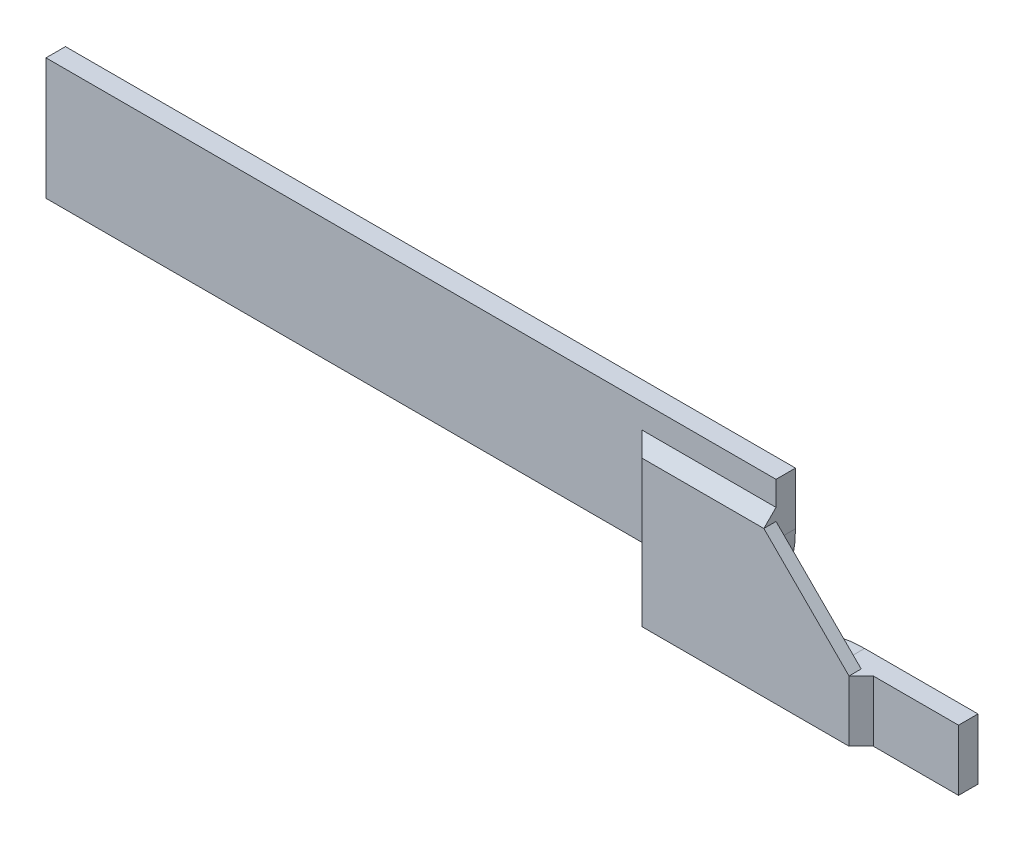
ISO-10303-21;
HEADER;
FILE_DESCRIPTION(('STEP AP214'),'2;1');
FILE_NAME('part.step','',(''),(''),'','','');
FILE_SCHEMA(('AUTOMOTIVE_DESIGN { 1 0 10303 214 1 1 1 1 }'));
ENDSEC;
DATA;
#1=APPLICATION_CONTEXT('core data for automotive mechanical design processes');
#2=APPLICATION_PROTOCOL_DEFINITION('international standard','automotive_design',2000,#1);
#3=PRODUCT_CONTEXT('',#1,'mechanical');
#4=PRODUCT('Part','Part','',(#3));
#5=PRODUCT_RELATED_PRODUCT_CATEGORY('part','',(#4));
#6=PRODUCT_DEFINITION_FORMATION('','',#4);
#7=PRODUCT_DEFINITION_CONTEXT('part definition',#1,'design');
#8=PRODUCT_DEFINITION('design','',#6,#7);
#9=PRODUCT_DEFINITION_SHAPE('','',#8);
#10=(LENGTH_UNIT() NAMED_UNIT(*) SI_UNIT(.MILLI.,.METRE.));
#11=(NAMED_UNIT(*) PLANE_ANGLE_UNIT() SI_UNIT($,.RADIAN.));
#12=(NAMED_UNIT(*) SI_UNIT($,.STERADIAN.) SOLID_ANGLE_UNIT());
#13=UNCERTAINTY_MEASURE_WITH_UNIT(LENGTH_MEASURE(1.E-05),#10,'distance_accuracy_value','');
#14=(GEOMETRIC_REPRESENTATION_CONTEXT(3) GLOBAL_UNCERTAINTY_ASSIGNED_CONTEXT((#13)) GLOBAL_UNIT_ASSIGNED_CONTEXT((#10,
#11,#12)) REPRESENTATION_CONTEXT('',''));
#15=CARTESIAN_POINT('',(0.,0.,0.));
#16=DIRECTION('',(0.,0.,1.));
#17=DIRECTION('',(1.,0.,0.));
#18=AXIS2_PLACEMENT_3D('',#15,#16,#17);
#19=CARTESIAN_POINT('',(60.,0.,1.6));
#20=DIRECTION('',(0.,0.,1.));
#21=DIRECTION('',(1.,0.,0.));
#22=AXIS2_PLACEMENT_3D('',#19,#20,#21);
#23=PLANE('',#22);
#24=DIRECTION('',(-1.,0.,0.));
#25=VECTOR('',#24,1.);
#26=CARTESIAN_POINT('',(75.,0.,1.6));
#27=LINE('',#26,#25);
#28=CARTESIAN_POINT('',(75.,0.,1.6));
#29=VERTEX_POINT('',#28);
#30=CARTESIAN_POINT('',(68.,0.,1.6));
#31=VERTEX_POINT('',#30);
#32=EDGE_CURVE('E198',#29,#31,#27,.T.);
#33=ORIENTED_EDGE('',*,*,#32,.T.);
#34=DIRECTION('',(0.,-1.,0.));
#35=VECTOR('',#34,1.);
#36=CARTESIAN_POINT('',(68.,0.,1.6));
#37=LINE('',#36,#35);
#38=CARTESIAN_POINT('',(68.,-5.,1.6));
#39=VERTEX_POINT('',#38);
#40=EDGE_CURVE('E250',#31,#39,#37,.T.);
#41=ORIENTED_EDGE('',*,*,#40,.T.);
#42=DIRECTION('',(1.,0.,0.));
#43=VECTOR('',#42,1.);
#44=CARTESIAN_POINT('',(50.,-5.,1.6));
#45=LINE('',#44,#43);
#46=CARTESIAN_POINT('',(75.,-5.,1.6));
#47=VERTEX_POINT('',#46);
#48=EDGE_CURVE('E193',#39,#47,#45,.T.);
#49=ORIENTED_EDGE('',*,*,#48,.T.);
#50=DIRECTION('',(0.,1.,0.));
#51=VECTOR('',#50,1.);
#52=CARTESIAN_POINT('',(75.,-5.,1.6));
#53=LINE('',#52,#51);
#54=EDGE_CURVE('E195',#47,#29,#53,.T.);
#55=ORIENTED_EDGE('',*,*,#54,.T.);
#56=EDGE_LOOP('',(#33,#41,#49,#55));
#57=FACE_BOUND('',#56,.T.);
#58=ADVANCED_FACE('F33',(#57),#23,.T.);
#59=CARTESIAN_POINT('',(0.,10.,1.6));
#60=DIRECTION('',(1.,0.,0.));
#61=DIRECTION('',(0.,1.,0.));
#62=AXIS2_PLACEMENT_3D('',#59,#60,#61);
#63=PLANE('',#62);
#64=DIRECTION('',(0.,-1.,0.));
#65=VECTOR('',#64,1.);
#66=CARTESIAN_POINT('',(0.,10.,0.));
#67=LINE('',#66,#65);
#68=CARTESIAN_POINT('',(0.,10.,0.));
#69=VERTEX_POINT('',#68);
#70=CARTESIAN_POINT('',(0.,0.,0.));
#71=VERTEX_POINT('',#70);
#72=EDGE_CURVE('E184',#69,#71,#67,.T.);
#73=ORIENTED_EDGE('',*,*,#72,.T.);
#74=DIRECTION('',(0.,0.,-1.));
#75=VECTOR('',#74,1.);
#76=CARTESIAN_POINT('',(0.,0.,1.6));
#77=LINE('',#76,#75);
#78=CARTESIAN_POINT('',(0.,0.,1.6));
#79=VERTEX_POINT('',#78);
#80=EDGE_CURVE('E244',#79,#71,#77,.T.);
#81=ORIENTED_EDGE('',*,*,#80,.F.);
#82=DIRECTION('',(0.,-1.,0.));
#83=VECTOR('',#82,1.);
#84=CARTESIAN_POINT('',(0.,10.,1.6));
#85=LINE('',#84,#83);
#86=CARTESIAN_POINT('',(0.,10.,1.6));
#87=VERTEX_POINT('',#86);
#88=EDGE_CURVE('E186',#87,#79,#85,.T.);
#89=ORIENTED_EDGE('',*,*,#88,.F.);
#90=DIRECTION('',(0.,0.,-1.));
#91=VECTOR('',#90,1.);
#92=CARTESIAN_POINT('',(0.,10.,1.6));
#93=LINE('',#92,#91);
#94=EDGE_CURVE('E208',#87,#69,#93,.T.);
#95=ORIENTED_EDGE('',*,*,#94,.T.);
#96=EDGE_LOOP('',(#73,#81,#89,#95));
#97=FACE_BOUND('',#96,.T.);
#98=ADVANCED_FACE('F316',(#97),#63,.F.);
#99=CARTESIAN_POINT('',(0.,0.,1.6));
#100=DIRECTION('',(0.,1.,0.));
#101=DIRECTION('',(-1.,0.,0.));
#102=AXIS2_PLACEMENT_3D('',#99,#100,#101);
#103=PLANE('',#102);
#104=DIRECTION('',(1.,0.,0.));
#105=VECTOR('',#104,1.);
#106=CARTESIAN_POINT('',(0.,0.,0.));
#107=LINE('',#106,#105);
#108=CARTESIAN_POINT('',(50.,0.,0.));
#109=VERTEX_POINT('',#108);
#110=EDGE_CURVE('E211',#71,#109,#107,.T.);
#111=ORIENTED_EDGE('',*,*,#110,.T.);
#112=DIRECTION('',(0.,0.,-1.));
#113=VECTOR('',#112,1.);
#114=CARTESIAN_POINT('',(50.,0.,1.6));
#115=LINE('',#114,#113);
#116=CARTESIAN_POINT('',(50.,0.,2.6));
#117=VERTEX_POINT('',#116);
#118=EDGE_CURVE('E241',#117,#109,#115,.T.);
#119=ORIENTED_EDGE('',*,*,#118,.F.);
#120=DIRECTION('',(-0.707106781186545,0.,-0.70710678118655));
#121=VECTOR('',#120,1.);
#122=CARTESIAN_POINT('',(24.5000000000002,0.,-22.9));
#123=LINE('',#122,#121);
#124=CARTESIAN_POINT('',(49.,0.,1.6));
#125=VERTEX_POINT('',#124);
#126=EDGE_CURVE('E166',#117,#125,#123,.T.);
#127=ORIENTED_EDGE('',*,*,#126,.T.);
#128=DIRECTION('',(1.,0.,0.));
#129=VECTOR('',#128,1.);
#130=CARTESIAN_POINT('',(0.,0.,1.6));
#131=LINE('',#130,#129);
#132=EDGE_CURVE('E189',#79,#125,#131,.T.);
#133=ORIENTED_EDGE('',*,*,#132,.F.);
#134=ORIENTED_EDGE('',*,*,#80,.T.);
#135=EDGE_LOOP('',(#111,#119,#127,#133,#134));
#136=FACE_BOUND('',#135,.T.);
#137=ADVANCED_FACE('F310',(#136),#103,.F.);
#138=CARTESIAN_POINT('',(50.,0.,1.6));
#139=DIRECTION('',(1.,0.,0.));
#140=DIRECTION('',(0.,0.,-1.));
#141=AXIS2_PLACEMENT_3D('',#138,#139,#140);
#142=PLANE('',#141);
#143=DIRECTION('',(0.,-1.,0.));
#144=VECTOR('',#143,1.);
#145=CARTESIAN_POINT('',(50.,-5.,2.6));
#146=LINE('',#145,#144);
#147=CARTESIAN_POINT('',(50.,-5.,2.6));
#148=VERTEX_POINT('',#147);
#149=EDGE_CURVE('E169',#117,#148,#146,.T.);
#150=ORIENTED_EDGE('',*,*,#149,.F.);
#151=ORIENTED_EDGE('',*,*,#118,.T.);
#152=DIRECTION('',(0.,-1.,0.));
#153=VECTOR('',#152,1.);
#154=CARTESIAN_POINT('',(50.,0.,0.));
#155=LINE('',#154,#153);
#156=CARTESIAN_POINT('',(50.,-5.,0.));
#157=VERTEX_POINT('',#156);
#158=EDGE_CURVE('E213',#109,#157,#155,.T.);
#159=ORIENTED_EDGE('',*,*,#158,.T.);
#160=DIRECTION('',(0.,0.,-1.));
#161=VECTOR('',#160,1.);
#162=CARTESIAN_POINT('',(50.,-5.,1.6));
#163=LINE('',#162,#161);
#164=EDGE_CURVE('E238',#148,#157,#163,.T.);
#165=ORIENTED_EDGE('',*,*,#164,.F.);
#166=EDGE_LOOP('',(#150,#151,#159,#165));
#167=FACE_BOUND('',#166,.T.);
#168=ADVANCED_FACE('F308',(#167),#142,.F.);
#169=CARTESIAN_POINT('',(50.,-5.,1.6));
#170=DIRECTION('',(0.,1.,0.));
#171=DIRECTION('',(0.,0.,1.));
#172=AXIS2_PLACEMENT_3D('',#169,#170,#171);
#173=PLANE('',#172);
#174=DIRECTION('',(1.,0.,0.));
#175=VECTOR('',#174,1.);
#176=CARTESIAN_POINT('',(50.,-5.,0.));
#177=LINE('',#176,#175);
#178=CARTESIAN_POINT('',(75.,-5.,0.));
#179=VERTEX_POINT('',#178);
#180=EDGE_CURVE('E215',#157,#179,#177,.T.);
#181=ORIENTED_EDGE('',*,*,#180,.T.);
#182=DIRECTION('',(0.,0.,-1.));
#183=VECTOR('',#182,1.);
#184=CARTESIAN_POINT('',(75.,-5.,1.6));
#185=LINE('',#184,#183);
#186=EDGE_CURVE('E235',#47,#179,#185,.T.);
#187=ORIENTED_EDGE('',*,*,#186,.F.);
#188=ORIENTED_EDGE('',*,*,#48,.F.);
#189=DIRECTION('',(-0.707106781186545,0.,0.70710678118655));
#190=VECTOR('',#189,1.);
#191=CARTESIAN_POINT('',(59.0000000000001,-5.,10.6));
#192=LINE('',#191,#190);
#193=CARTESIAN_POINT('',(67.,-5.,2.6));
#194=VERTEX_POINT('',#193);
#195=EDGE_CURVE('E257',#39,#194,#192,.T.);
#196=ORIENTED_EDGE('',*,*,#195,.T.);
#197=DIRECTION('',(1.,0.,0.));
#198=VECTOR('',#197,1.);
#199=CARTESIAN_POINT('',(67.,-5.,2.6));
#200=LINE('',#199,#198);
#201=EDGE_CURVE('E168',#148,#194,#200,.T.);
#202=ORIENTED_EDGE('',*,*,#201,.F.);
#203=ORIENTED_EDGE('',*,*,#164,.T.);
#204=EDGE_LOOP('',(#181,#187,#188,#196,#202,#203));
#205=FACE_BOUND('',#204,.T.);
#206=ADVANCED_FACE('F302',(#205),#173,.F.);
#207=CARTESIAN_POINT('',(75.,-5.,1.6));
#208=DIRECTION('',(-1.,0.,0.));
#209=DIRECTION('',(0.,0.,1.));
#210=AXIS2_PLACEMENT_3D('',#207,#208,#209);
#211=PLANE('',#210);
#212=DIRECTION('',(0.,1.,0.));
#213=VECTOR('',#212,1.);
#214=CARTESIAN_POINT('',(75.,-5.,0.));
#215=LINE('',#214,#213);
#216=CARTESIAN_POINT('',(75.,0.,0.));
#217=VERTEX_POINT('',#216);
#218=EDGE_CURVE('E217',#179,#217,#215,.T.);
#219=ORIENTED_EDGE('',*,*,#218,.T.);
#220=DIRECTION('',(0.,0.,-1.));
#221=VECTOR('',#220,1.);
#222=CARTESIAN_POINT('',(75.,0.,1.6));
#223=LINE('',#222,#221);
#224=EDGE_CURVE('E232',#29,#217,#223,.T.);
#225=ORIENTED_EDGE('',*,*,#224,.F.);
#226=ORIENTED_EDGE('',*,*,#54,.F.);
#227=ORIENTED_EDGE('',*,*,#186,.T.);
#228=EDGE_LOOP('',(#219,#225,#226,#227));
#229=FACE_BOUND('',#228,.T.);
#230=ADVANCED_FACE('F297',(#229),#211,.F.);
#231=CARTESIAN_POINT('',(75.,0.,1.6));
#232=DIRECTION('',(0.,-1.,0.));
#233=DIRECTION('',(1.,0.,0.));
#234=AXIS2_PLACEMENT_3D('',#231,#232,#233);
#235=PLANE('',#234);
#236=DIRECTION('',(-1.,0.,0.));
#237=VECTOR('',#236,1.);
#238=CARTESIAN_POINT('',(75.,0.,0.));
#239=LINE('',#238,#237);
#240=CARTESIAN_POINT('',(65.6789083458003,0.,0.));
#241=VERTEX_POINT('',#240);
#242=EDGE_CURVE('E219',#217,#241,#239,.T.);
#243=ORIENTED_EDGE('',*,*,#242,.T.);
#244=DIRECTION('',(0.,0.,-1.));
#245=VECTOR('',#244,1.);
#246=CARTESIAN_POINT('',(65.6789083458003,0.,1.6));
#247=LINE('',#246,#245);
#248=CARTESIAN_POINT('',(65.6789083458003,0.,1.6));
#249=VERTEX_POINT('',#248);
#250=EDGE_CURVE('E54',#241,#249,#247,.F.);
#251=ORIENTED_EDGE('',*,*,#250,.T.);
#252=CARTESIAN_POINT('',(67.,0.,1.6));
#253=VERTEX_POINT('',#252);
#254=EDGE_CURVE('E197',#253,#249,#27,.T.);
#255=ORIENTED_EDGE('',*,*,#254,.F.);
#256=DIRECTION('',(0.,0.,1.));
#257=VECTOR('',#256,1.);
#258=CARTESIAN_POINT('',(67.,0.,2.6));
#259=LINE('',#258,#257);
#260=CARTESIAN_POINT('',(67.,0.,2.60000000000001));
#261=VERTEX_POINT('',#260);
#262=EDGE_CURVE('E262',#253,#261,#259,.T.);
#263=ORIENTED_EDGE('',*,*,#262,.T.);
#264=DIRECTION('',(0.707106781186545,0.,-0.70710678118655));
#265=VECTOR('',#264,1.);
#266=CARTESIAN_POINT('',(71.5,0.,-1.9));
#267=LINE('',#266,#265);
#268=EDGE_CURVE('E255',#261,#31,#267,.T.);
#269=ORIENTED_EDGE('',*,*,#268,.T.);
#270=ORIENTED_EDGE('',*,*,#32,.F.);
#271=ORIENTED_EDGE('',*,*,#224,.T.);
#272=EDGE_LOOP('',(#243,#251,#255,#263,#269,#270,#271));
#273=FACE_BOUND('',#272,.T.);
#274=ADVANCED_FACE('F292',(#273),#235,.F.);
#275=CARTESIAN_POINT('',(60.,0.,1.6));
#276=DIRECTION('',(0.,0.,-1.));
#277=DIRECTION('',(-1.,0.,0.));
#278=AXIS2_PLACEMENT_3D('',#275,#276,#277);
#279=CYLINDRICAL_SURFACE('',#278,1.5);
#280=CARTESIAN_POINT('',(60.,0.,1.6));
#281=DIRECTION('',(0.,0.,-1.));
#282=DIRECTION('',(1.,0.,0.));
#283=AXIS2_PLACEMENT_3D('',#280,#281,#282);
#284=CIRCLE('',#283,1.5);
#285=CARTESIAN_POINT('',(60.7407271755392,-1.30434782608696,1.6));
#286=VERTEX_POINT('',#285);
#287=CARTESIAN_POINT('',(58.695652173913,0.740727175539162,1.6));
#288=VERTEX_POINT('',#287);
#289=EDGE_CURVE('E201',#286,#288,#284,.T.);
#290=ORIENTED_EDGE('',*,*,#289,.F.);
#291=DIRECTION('',(0.,0.,-1.));
#292=VECTOR('',#291,1.);
#293=CARTESIAN_POINT('',(60.7407271755392,-1.30434782608696,1.6));
#294=LINE('',#293,#292);
#295=CARTESIAN_POINT('',(60.7407271755392,-1.30434782608696,0.));
#296=VERTEX_POINT('',#295);
#297=EDGE_CURVE('E267',#286,#296,#294,.T.);
#298=ORIENTED_EDGE('',*,*,#297,.T.);
#299=CARTESIAN_POINT('',(60.,0.,0.));
#300=DIRECTION('',(0.,0.,-1.));
#301=DIRECTION('',(1.,0.,0.));
#302=AXIS2_PLACEMENT_3D('',#299,#300,#301);
#303=CIRCLE('',#302,1.5);
#304=CARTESIAN_POINT('',(58.695652173913,0.740727175539162,0.));
#305=VERTEX_POINT('',#304);
#306=EDGE_CURVE('E221',#296,#305,#303,.T.);
#307=ORIENTED_EDGE('',*,*,#306,.T.);
#308=DIRECTION('',(0.,0.,-1.));
#309=VECTOR('',#308,1.);
#310=CARTESIAN_POINT('',(58.695652173913,0.740727175539163,1.6));
#311=LINE('',#310,#309);
#312=EDGE_CURVE('E264',#305,#288,#311,.F.);
#313=ORIENTED_EDGE('',*,*,#312,.T.);
#314=EDGE_LOOP('',(#290,#298,#307,#313));
#315=FACE_BOUND('',#314,.T.);
#316=ADVANCED_FACE('F284',(#315),#279,.F.);
#317=CARTESIAN_POINT('',(60.,1.5,1.6));
#318=DIRECTION('',(-1.,0.,0.));
#319=DIRECTION('',(0.,0.,1.));
#320=AXIS2_PLACEMENT_3D('',#317,#318,#319);
#321=PLANE('',#320);
#322=DIRECTION('',(0.,1.,0.));
#323=VECTOR('',#322,1.);
#324=CARTESIAN_POINT('',(60.,1.5,1.6));
#325=LINE('',#324,#323);
#326=CARTESIAN_POINT('',(60.,5.67890834580027,1.6));
#327=VERTEX_POINT('',#326);
#328=CARTESIAN_POINT('',(60.,7.,1.6));
#329=VERTEX_POINT('',#328);
#330=EDGE_CURVE('E204',#327,#329,#325,.T.);
#331=ORIENTED_EDGE('',*,*,#330,.F.);
#332=DIRECTION('',(0.,0.,-1.));
#333=VECTOR('',#332,1.);
#334=CARTESIAN_POINT('',(60.,5.67890834580027,1.6));
#335=LINE('',#334,#333);
#336=CARTESIAN_POINT('',(60.,5.67890834580027,0.));
#337=VERTEX_POINT('',#336);
#338=EDGE_CURVE('E275',#327,#337,#335,.T.);
#339=ORIENTED_EDGE('',*,*,#338,.T.);
#340=DIRECTION('',(0.,1.,0.));
#341=VECTOR('',#340,1.);
#342=CARTESIAN_POINT('',(60.,1.5,0.));
#343=LINE('',#342,#341);
#344=CARTESIAN_POINT('',(60.,10.,0.));
#345=VERTEX_POINT('',#344);
#346=EDGE_CURVE('E224',#337,#345,#343,.T.);
#347=ORIENTED_EDGE('',*,*,#346,.T.);
#348=DIRECTION('',(0.,0.,-1.));
#349=VECTOR('',#348,1.);
#350=CARTESIAN_POINT('',(60.,10.,1.6));
#351=LINE('',#350,#349);
#352=CARTESIAN_POINT('',(60.,10.,1.6));
#353=VERTEX_POINT('',#352);
#354=EDGE_CURVE('E229',#353,#345,#351,.T.);
#355=ORIENTED_EDGE('',*,*,#354,.F.);
#356=CARTESIAN_POINT('',(60.,8.,1.6));
#357=VERTEX_POINT('',#356);
#358=EDGE_CURVE('E203',#357,#353,#325,.T.);
#359=ORIENTED_EDGE('',*,*,#358,.F.);
#360=DIRECTION('',(0.,-0.707106781186545,0.70710678118655));
#361=VECTOR('',#360,1.);
#362=CARTESIAN_POINT('',(60.,4.75000000000002,4.85));
#363=LINE('',#362,#361);
#364=CARTESIAN_POINT('',(60.,7.,2.6));
#365=VERTEX_POINT('',#364);
#366=EDGE_CURVE('E252',#357,#365,#363,.T.);
#367=ORIENTED_EDGE('',*,*,#366,.T.);
#368=DIRECTION('',(0.,0.,1.));
#369=VECTOR('',#368,1.);
#370=CARTESIAN_POINT('',(60.,7.,1.6));
#371=LINE('',#370,#369);
#372=EDGE_CURVE('E259',#329,#365,#371,.T.);
#373=ORIENTED_EDGE('',*,*,#372,.F.);
#374=EDGE_LOOP('',(#331,#339,#347,#355,#359,#367,#373));
#375=FACE_BOUND('',#374,.T.);
#376=ADVANCED_FACE('F325',(#375),#321,.F.);
#377=CARTESIAN_POINT('',(60.,10.,1.6));
#378=DIRECTION('',(0.,-1.,0.));
#379=DIRECTION('',(1.,0.,0.));
#380=AXIS2_PLACEMENT_3D('',#377,#378,#379);
#381=PLANE('',#380);
#382=DIRECTION('',(-1.,0.,0.));
#383=VECTOR('',#382,1.);
#384=CARTESIAN_POINT('',(60.,10.,0.));
#385=LINE('',#384,#383);
#386=EDGE_CURVE('E190',#345,#69,#385,.T.);
#387=ORIENTED_EDGE('',*,*,#386,.T.);
#388=ORIENTED_EDGE('',*,*,#94,.F.);
#389=DIRECTION('',(-1.,0.,0.));
#390=VECTOR('',#389,1.);
#391=CARTESIAN_POINT('',(60.,10.,1.6));
#392=LINE('',#391,#390);
#393=EDGE_CURVE('E206',#353,#87,#392,.T.);
#394=ORIENTED_EDGE('',*,*,#393,.F.);
#395=ORIENTED_EDGE('',*,*,#354,.T.);
#396=EDGE_LOOP('',(#387,#388,#394,#395));
#397=FACE_BOUND('',#396,.T.);
#398=ADVANCED_FACE('F321',(#397),#381,.F.);
#399=DIRECTION('',(0.,1.,0.));
#400=VECTOR('',#399,1.);
#401=CARTESIAN_POINT('',(49.,0.,1.6));
#402=LINE('',#401,#400);
#403=CARTESIAN_POINT('',(49.,8.,1.6));
#404=VERTEX_POINT('',#403);
#405=EDGE_CURVE('E247',#125,#404,#402,.T.);
#406=ORIENTED_EDGE('',*,*,#405,.T.);
#407=DIRECTION('',(1.,0.,0.));
#408=VECTOR('',#407,1.);
#409=CARTESIAN_POINT('',(60.,8.,1.6));
#410=LINE('',#409,#408);
#411=EDGE_CURVE('E157',#404,#357,#410,.T.);
#412=ORIENTED_EDGE('',*,*,#411,.T.);
#413=ORIENTED_EDGE('',*,*,#358,.T.);
#414=ORIENTED_EDGE('',*,*,#393,.T.);
#415=ORIENTED_EDGE('',*,*,#88,.T.);
#416=ORIENTED_EDGE('',*,*,#132,.T.);
#417=EDGE_LOOP('',(#406,#412,#413,#414,#415,#416));
#418=FACE_BOUND('',#417,.T.);
#419=ADVANCED_FACE('F336',(#418),#23,.T.);
#420=CARTESIAN_POINT('',(60.,0.,0.));
#421=DIRECTION('',(0.,0.,1.));
#422=DIRECTION('',(1.,0.,0.));
#423=AXIS2_PLACEMENT_3D('',#420,#421,#422);
#424=PLANE('',#423);
#425=ORIENTED_EDGE('',*,*,#306,.F.);
#426=CARTESIAN_POINT('',(65.6789083458003,-10.,0.));
#427=DIRECTION('',(0.,0.,1.));
#428=DIRECTION('',(1.,0.,0.));
#429=AXIS2_PLACEMENT_3D('',#426,#427,#428);
#430=CIRCLE('',#429,10.);
#431=EDGE_CURVE('E272',#296,#241,#430,.F.);
#432=ORIENTED_EDGE('',*,*,#431,.T.);
#433=ORIENTED_EDGE('',*,*,#242,.F.);
#434=ORIENTED_EDGE('',*,*,#218,.F.);
#435=ORIENTED_EDGE('',*,*,#180,.F.);
#436=ORIENTED_EDGE('',*,*,#158,.F.);
#437=ORIENTED_EDGE('',*,*,#110,.F.);
#438=ORIENTED_EDGE('',*,*,#72,.F.);
#439=ORIENTED_EDGE('',*,*,#386,.F.);
#440=ORIENTED_EDGE('',*,*,#346,.F.);
#441=CARTESIAN_POINT('',(50.,5.67890834580027,0.));
#442=DIRECTION('',(0.,0.,1.));
#443=DIRECTION('',(1.,0.,0.));
#444=AXIS2_PLACEMENT_3D('',#441,#442,#443);
#445=CIRCLE('',#444,10.);
#446=EDGE_CURVE('E270',#337,#305,#445,.F.);
#447=ORIENTED_EDGE('',*,*,#446,.T.);
#448=EDGE_LOOP('',(#425,#432,#433,#434,#435,#436,#437,#438,#439,#440,#447));
#449=FACE_BOUND('',#448,.T.);
#450=ADVANCED_FACE('F290',(#449),#424,.F.);
#451=CARTESIAN_POINT('',(60.,7.,2.6));
#452=DIRECTION('',(-0.707106781186547,-0.707106781186548,0.));
#453=DIRECTION('',(0.707106781186548,-0.707106781186547,0.));
#454=AXIS2_PLACEMENT_3D('',#451,#452,#453);
#455=PLANE('',#454);
#456=DIRECTION('',(-0.707106781186548,0.707106781186547,0.));
#457=VECTOR('',#456,1.);
#458=CARTESIAN_POINT('',(60.,7.,1.6));
#459=LINE('',#458,#457);
#460=EDGE_CURVE('E160',#253,#329,#459,.T.);
#461=ORIENTED_EDGE('',*,*,#460,.T.);
#462=ORIENTED_EDGE('',*,*,#372,.T.);
#463=DIRECTION('',(-0.707106781186548,0.707106781186547,0.));
#464=VECTOR('',#463,1.);
#465=CARTESIAN_POINT('',(60.,7.,2.6));
#466=LINE('',#465,#464);
#467=EDGE_CURVE('E174',#261,#365,#466,.T.);
#468=ORIENTED_EDGE('',*,*,#467,.F.);
#469=ORIENTED_EDGE('',*,*,#262,.F.);
#470=EDGE_LOOP('',(#461,#462,#468,#469));
#471=FACE_BOUND('',#470,.T.);
#472=ADVANCED_FACE('F349',(#471),#455,.F.);
#473=CARTESIAN_POINT('',(0.,0.,2.6));
#474=DIRECTION('',(0.,0.,-1.));
#475=DIRECTION('',(-1.,0.,0.));
#476=AXIS2_PLACEMENT_3D('',#473,#474,#475);
#477=PLANE('',#476);
#478=DIRECTION('',(-1.,0.,0.));
#479=VECTOR('',#478,1.);
#480=CARTESIAN_POINT('',(50.,7.,2.6));
#481=LINE('',#480,#479);
#482=CARTESIAN_POINT('',(50.,7.,2.6));
#483=VERTEX_POINT('',#482);
#484=EDGE_CURVE('E156',#365,#483,#481,.T.);
#485=ORIENTED_EDGE('',*,*,#484,.T.);
#486=EDGE_CURVE('E164',#483,#117,#146,.T.);
#487=ORIENTED_EDGE('',*,*,#486,.T.);
#488=ORIENTED_EDGE('',*,*,#149,.T.);
#489=ORIENTED_EDGE('',*,*,#201,.T.);
#490=DIRECTION('',(0.,1.,0.));
#491=VECTOR('',#490,1.);
#492=CARTESIAN_POINT('',(67.,0.,2.6));
#493=LINE('',#492,#491);
#494=EDGE_CURVE('E182',#194,#261,#493,.T.);
#495=ORIENTED_EDGE('',*,*,#494,.T.);
#496=ORIENTED_EDGE('',*,*,#467,.T.);
#497=EDGE_LOOP('',(#485,#487,#488,#489,#495,#496));
#498=FACE_BOUND('',#497,.T.);
#499=ADVANCED_FACE('F171',(#498),#477,.F.);
#500=CARTESIAN_POINT('',(0.,0.,1.6));
#501=DIRECTION('',(0.,0.,-1.));
#502=DIRECTION('',(-1.,0.,0.));
#503=AXIS2_PLACEMENT_3D('',#500,#501,#502);
#504=PLANE('',#503);
#505=ORIENTED_EDGE('',*,*,#460,.F.);
#506=ORIENTED_EDGE('',*,*,#254,.T.);
#507=CARTESIAN_POINT('',(65.6789083458003,-10.,1.6));
#508=DIRECTION('',(0.,0.,-1.));
#509=DIRECTION('',(-1.,0.,0.));
#510=AXIS2_PLACEMENT_3D('',#507,#508,#509);
#511=CIRCLE('',#510,10.);
#512=EDGE_CURVE('E41',#249,#286,#511,.F.);
#513=ORIENTED_EDGE('',*,*,#512,.T.);
#514=ORIENTED_EDGE('',*,*,#289,.T.);
#515=CARTESIAN_POINT('',(50.,5.67890834580027,1.6));
#516=DIRECTION('',(0.,0.,-1.));
#517=DIRECTION('',(-1.,0.,0.));
#518=AXIS2_PLACEMENT_3D('',#515,#516,#517);
#519=CIRCLE('',#518,10.);
#520=EDGE_CURVE('E11',#288,#327,#519,.F.);
#521=ORIENTED_EDGE('',*,*,#520,.T.);
#522=ORIENTED_EDGE('',*,*,#330,.T.);
#523=EDGE_LOOP('',(#505,#506,#513,#514,#521,#522));
#524=FACE_BOUND('',#523,.T.);
#525=ADVANCED_FACE('F280',(#524),#504,.T.);
#526=CARTESIAN_POINT('',(50.,0.,2.60000000000001));
#527=DIRECTION('',(0.70710678118655,0.,-0.707106781186545));
#528=DIRECTION('',(0.,-1.,0.));
#529=AXIS2_PLACEMENT_3D('',#526,#527,#528);
#530=PLANE('',#529);
#531=ORIENTED_EDGE('',*,*,#126,.F.);
#532=ORIENTED_EDGE('',*,*,#486,.F.);
#533=DIRECTION('',(-0.577350269189624,0.577350269189624,-0.577350269189628));
#534=VECTOR('',#533,1.);
#535=CARTESIAN_POINT('',(52.3333333333333,4.66666666666668,4.93333333333335));
#536=LINE('',#535,#534);
#537=EDGE_CURVE('E151',#404,#483,#536,.F.);
#538=ORIENTED_EDGE('',*,*,#537,.F.);
#539=ORIENTED_EDGE('',*,*,#405,.F.);
#540=EDGE_LOOP('',(#531,#532,#538,#539));
#541=FACE_BOUND('',#540,.T.);
#542=ADVANCED_FACE('F165',(#541),#530,.F.);
#543=CARTESIAN_POINT('',(50.,7.,2.60000000000001));
#544=DIRECTION('',(0.,-0.70710678118655,-0.707106781186545));
#545=DIRECTION('',(-1.,0.,0.));
#546=AXIS2_PLACEMENT_3D('',#543,#544,#545);
#547=PLANE('',#546);
#548=ORIENTED_EDGE('',*,*,#366,.F.);
#549=ORIENTED_EDGE('',*,*,#411,.F.);
#550=ORIENTED_EDGE('',*,*,#537,.T.);
#551=ORIENTED_EDGE('',*,*,#484,.F.);
#552=EDGE_LOOP('',(#548,#549,#550,#551));
#553=FACE_BOUND('',#552,.T.);
#554=ADVANCED_FACE('F154',(#553),#547,.F.);
#555=CARTESIAN_POINT('',(67.,0.,2.60000000000001));
#556=DIRECTION('',(-0.70710678118655,0.,-0.707106781186545));
#557=DIRECTION('',(0.,1.,0.));
#558=AXIS2_PLACEMENT_3D('',#555,#556,#557);
#559=PLANE('',#558);
#560=ORIENTED_EDGE('',*,*,#195,.F.);
#561=ORIENTED_EDGE('',*,*,#40,.F.);
#562=ORIENTED_EDGE('',*,*,#268,.F.);
#563=ORIENTED_EDGE('',*,*,#494,.F.);
#564=EDGE_LOOP('',(#560,#561,#562,#563));
#565=FACE_BOUND('',#564,.T.);
#566=ADVANCED_FACE('F332',(#565),#559,.F.);
#567=CARTESIAN_POINT('',(65.6789083458003,-10.,1.6));
#568=DIRECTION('',(0.,0.,-1.));
#569=DIRECTION('',(-1.,0.,0.));
#570=AXIS2_PLACEMENT_3D('',#567,#568,#569);
#571=CYLINDRICAL_SURFACE('',#570,10.);
#572=ORIENTED_EDGE('',*,*,#512,.F.);
#573=ORIENTED_EDGE('',*,*,#250,.F.);
#574=ORIENTED_EDGE('',*,*,#431,.F.);
#575=ORIENTED_EDGE('',*,*,#297,.F.);
#576=EDGE_LOOP('',(#572,#573,#574,#575));
#577=FACE_BOUND('',#576,.T.);
#578=ADVANCED_FACE('F287',(#577),#571,.T.);
#579=CARTESIAN_POINT('',(50.,5.67890834580027,1.6));
#580=DIRECTION('',(0.,0.,-1.));
#581=DIRECTION('',(-1.,0.,0.));
#582=AXIS2_PLACEMENT_3D('',#579,#580,#581);
#583=CYLINDRICAL_SURFACE('',#582,10.);
#584=ORIENTED_EDGE('',*,*,#520,.F.);
#585=ORIENTED_EDGE('',*,*,#312,.F.);
#586=ORIENTED_EDGE('',*,*,#446,.F.);
#587=ORIENTED_EDGE('',*,*,#338,.F.);
#588=EDGE_LOOP('',(#584,#585,#586,#587));
#589=FACE_BOUND('',#588,.T.);
#590=ADVANCED_FACE('F35',(#589),#583,.T.);
#591=CLOSED_SHELL('',(#58,#98,#137,#168,#206,#230,#274,#316,#376,#398,#419,#450,#472,#499,#525,
#542,#554,#566,#578,#590));
#592=MANIFOLD_SOLID_BREP('B2',#591);
#593=ADVANCED_BREP_SHAPE_REPRESENTATION('',(#18,#592),#14);
#594=SHAPE_DEFINITION_REPRESENTATION(#9,#593);
ENDSEC;
END-ISO-10303-21;
